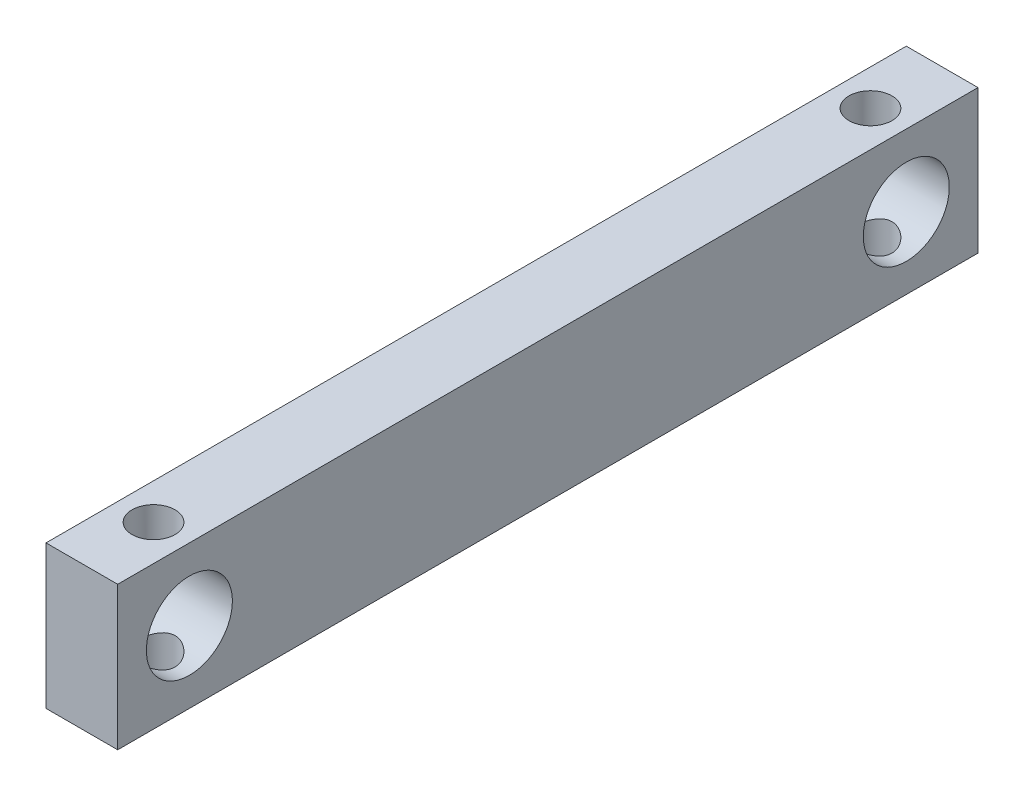
ISO-10303-21;
HEADER;
FILE_DESCRIPTION(('STEP AP214'),'2;1');
FILE_NAME('part.step','',(''),(''),'','','');
FILE_SCHEMA(('AUTOMOTIVE_DESIGN { 1 0 10303 214 1 1 1 1 }'));
ENDSEC;
DATA;
#1=APPLICATION_CONTEXT('core data for automotive mechanical design processes');
#2=APPLICATION_PROTOCOL_DEFINITION('international standard','automotive_design',2000,#1);
#3=PRODUCT_CONTEXT('',#1,'mechanical');
#4=PRODUCT('Part','Part','',(#3));
#5=PRODUCT_RELATED_PRODUCT_CATEGORY('part','',(#4));
#6=PRODUCT_DEFINITION_FORMATION('','',#4);
#7=PRODUCT_DEFINITION_CONTEXT('part definition',#1,'design');
#8=PRODUCT_DEFINITION('design','',#6,#7);
#9=PRODUCT_DEFINITION_SHAPE('','',#8);
#10=(LENGTH_UNIT() NAMED_UNIT(*) SI_UNIT(.MILLI.,.METRE.));
#11=(NAMED_UNIT(*) PLANE_ANGLE_UNIT() SI_UNIT($,.RADIAN.));
#12=(NAMED_UNIT(*) SI_UNIT($,.STERADIAN.) SOLID_ANGLE_UNIT());
#13=UNCERTAINTY_MEASURE_WITH_UNIT(LENGTH_MEASURE(1.E-05),#10,'distance_accuracy_value','');
#14=(GEOMETRIC_REPRESENTATION_CONTEXT(3) GLOBAL_UNCERTAINTY_ASSIGNED_CONTEXT((#13)) GLOBAL_UNIT_ASSIGNED_CONTEXT((#10,
#11,#12)) REPRESENTATION_CONTEXT('',''));
#15=CARTESIAN_POINT('',(0.,0.,0.));
#16=DIRECTION('',(0.,0.,1.));
#17=DIRECTION('',(1.,0.,0.));
#18=AXIS2_PLACEMENT_3D('',#15,#16,#17);
#19=CARTESIAN_POINT('',(2.5,0.,0.));
#20=DIRECTION('',(-1.,0.,0.));
#21=DIRECTION('',(0.,0.,1.));
#22=AXIS2_PLACEMENT_3D('',#19,#20,#21);
#23=PLANE('',#22);
#24=DIRECTION('',(0.,1.,0.));
#25=VECTOR('',#24,1.);
#26=CARTESIAN_POINT('',(2.5,-5.,-30.));
#27=LINE('',#26,#25);
#28=CARTESIAN_POINT('',(2.5,-5.,-30.));
#29=VERTEX_POINT('',#28);
#30=CARTESIAN_POINT('',(2.5,5.,-30.));
#31=VERTEX_POINT('',#30);
#32=EDGE_CURVE('E99',#29,#31,#27,.T.);
#33=ORIENTED_EDGE('',*,*,#32,.T.);
#34=DIRECTION('',(0.,0.,1.));
#35=VECTOR('',#34,1.);
#36=CARTESIAN_POINT('',(2.5,5.,30.));
#37=LINE('',#36,#35);
#38=CARTESIAN_POINT('',(2.5,5.,30.));
#39=VERTEX_POINT('',#38);
#40=EDGE_CURVE('E94',#31,#39,#37,.T.);
#41=ORIENTED_EDGE('',*,*,#40,.T.);
#42=DIRECTION('',(0.,-1.,0.));
#43=VECTOR('',#42,1.);
#44=CARTESIAN_POINT('',(2.5,-5.,30.));
#45=LINE('',#44,#43);
#46=CARTESIAN_POINT('',(2.5,-5.,30.));
#47=VERTEX_POINT('',#46);
#48=EDGE_CURVE('E97',#39,#47,#45,.T.);
#49=ORIENTED_EDGE('',*,*,#48,.T.);
#50=DIRECTION('',(0.,0.,-1.));
#51=VECTOR('',#50,1.);
#52=CARTESIAN_POINT('',(2.5,-5.,30.));
#53=LINE('',#52,#51);
#54=EDGE_CURVE('E64',#47,#29,#53,.T.);
#55=ORIENTED_EDGE('',*,*,#54,.T.);
#56=EDGE_LOOP('',(#33,#41,#49,#55));
#57=FACE_BOUND('',#56,.T.);
#58=CARTESIAN_POINT('',(2.5,0.,25.));
#59=DIRECTION('',(1.,0.,0.));
#60=DIRECTION('',(0.,0.,-1.));
#61=AXIS2_PLACEMENT_3D('',#58,#59,#60);
#62=CIRCLE('',#61,3.);
#63=CARTESIAN_POINT('',(2.5,0.,22.));
#64=VERTEX_POINT('',#63);
#65=EDGE_CURVE('E120',#64,#64,#62,.T.);
#66=ORIENTED_EDGE('',*,*,#65,.F.);
#67=EDGE_LOOP('',(#66));
#68=FACE_BOUND('',#67,.T.);
#69=CARTESIAN_POINT('',(2.5,0.,-25.));
#70=DIRECTION('',(1.,0.,0.));
#71=DIRECTION('',(0.,0.,1.));
#72=AXIS2_PLACEMENT_3D('',#69,#70,#71);
#73=CIRCLE('',#72,3.);
#74=CARTESIAN_POINT('',(2.5,0.,-22.));
#75=VERTEX_POINT('',#74);
#76=EDGE_CURVE('E205',#75,#75,#73,.T.);
#77=ORIENTED_EDGE('',*,*,#76,.F.);
#78=EDGE_LOOP('',(#77));
#79=FACE_BOUND('',#78,.T.);
#80=ADVANCED_FACE('F39',(#57,#68,#79),#23,.F.);
#81=CARTESIAN_POINT('',(-2.5,0.,0.));
#82=DIRECTION('',(-1.,0.,0.));
#83=DIRECTION('',(0.,0.,1.));
#84=AXIS2_PLACEMENT_3D('',#81,#82,#83);
#85=PLANE('',#84);
#86=CARTESIAN_POINT('',(-2.5,0.,25.));
#87=DIRECTION('',(1.,0.,0.));
#88=DIRECTION('',(0.,0.,-1.));
#89=AXIS2_PLACEMENT_3D('',#86,#87,#88);
#90=CIRCLE('',#89,3.);
#91=CARTESIAN_POINT('',(-2.5,0.,22.));
#92=VERTEX_POINT('',#91);
#93=EDGE_CURVE('E209',#92,#92,#90,.T.);
#94=ORIENTED_EDGE('',*,*,#93,.T.);
#95=EDGE_LOOP('',(#94));
#96=FACE_BOUND('',#95,.T.);
#97=DIRECTION('',(0.,1.,0.));
#98=VECTOR('',#97,1.);
#99=CARTESIAN_POINT('',(-2.5,-5.,-30.));
#100=LINE('',#99,#98);
#101=CARTESIAN_POINT('',(-2.5,-5.,-30.));
#102=VERTEX_POINT('',#101);
#103=CARTESIAN_POINT('',(-2.5,5.,-30.));
#104=VERTEX_POINT('',#103);
#105=EDGE_CURVE('E116',#102,#104,#100,.T.);
#106=ORIENTED_EDGE('',*,*,#105,.F.);
#107=DIRECTION('',(0.,0.,-1.));
#108=VECTOR('',#107,1.);
#109=CARTESIAN_POINT('',(-2.5,-5.,30.));
#110=LINE('',#109,#108);
#111=CARTESIAN_POINT('',(-2.5,-5.,30.));
#112=VERTEX_POINT('',#111);
#113=EDGE_CURVE('E87',#112,#102,#110,.T.);
#114=ORIENTED_EDGE('',*,*,#113,.F.);
#115=DIRECTION('',(0.,-1.,0.));
#116=VECTOR('',#115,1.);
#117=CARTESIAN_POINT('',(-2.5,-5.,30.));
#118=LINE('',#117,#116);
#119=CARTESIAN_POINT('',(-2.5,5.,30.));
#120=VERTEX_POINT('',#119);
#121=EDGE_CURVE('E81',#120,#112,#118,.T.);
#122=ORIENTED_EDGE('',*,*,#121,.F.);
#123=DIRECTION('',(0.,0.,1.));
#124=VECTOR('',#123,1.);
#125=CARTESIAN_POINT('',(-2.5,5.,30.));
#126=LINE('',#125,#124);
#127=EDGE_CURVE('E104',#104,#120,#126,.T.);
#128=ORIENTED_EDGE('',*,*,#127,.F.);
#129=EDGE_LOOP('',(#106,#114,#122,#128));
#130=FACE_BOUND('',#129,.T.);
#131=CARTESIAN_POINT('',(-2.5,0.,-25.));
#132=DIRECTION('',(1.,0.,0.));
#133=DIRECTION('',(0.,0.,1.));
#134=AXIS2_PLACEMENT_3D('',#131,#132,#133);
#135=CIRCLE('',#134,3.);
#136=CARTESIAN_POINT('',(-2.5,0.,-22.));
#137=VERTEX_POINT('',#136);
#138=EDGE_CURVE('E210',#137,#137,#135,.T.);
#139=ORIENTED_EDGE('',*,*,#138,.T.);
#140=EDGE_LOOP('',(#139));
#141=FACE_BOUND('',#140,.T.);
#142=ADVANCED_FACE('F174',(#96,#130,#141),#85,.T.);
#143=CARTESIAN_POINT('',(2.5,-5.,-30.));
#144=DIRECTION('',(0.,0.,1.));
#145=DIRECTION('',(1.,0.,0.));
#146=AXIS2_PLACEMENT_3D('',#143,#144,#145);
#147=PLANE('',#146);
#148=ORIENTED_EDGE('',*,*,#105,.T.);
#149=DIRECTION('',(-1.,0.,0.));
#150=VECTOR('',#149,1.);
#151=CARTESIAN_POINT('',(2.5,5.,-30.));
#152=LINE('',#151,#150);
#153=EDGE_CURVE('E11',#31,#104,#152,.T.);
#154=ORIENTED_EDGE('',*,*,#153,.F.);
#155=ORIENTED_EDGE('',*,*,#32,.F.);
#156=DIRECTION('',(-1.,0.,0.));
#157=VECTOR('',#156,1.);
#158=CARTESIAN_POINT('',(2.5,-5.,-30.));
#159=LINE('',#158,#157);
#160=EDGE_CURVE('E112',#29,#102,#159,.T.);
#161=ORIENTED_EDGE('',*,*,#160,.T.);
#162=EDGE_LOOP('',(#148,#154,#155,#161));
#163=FACE_BOUND('',#162,.T.);
#164=ADVANCED_FACE('F41',(#163),#147,.F.);
#165=CARTESIAN_POINT('',(2.5,5.,30.));
#166=DIRECTION('',(0.,-1.,0.));
#167=DIRECTION('',(0.,0.,-1.));
#168=AXIS2_PLACEMENT_3D('',#165,#166,#167);
#169=PLANE('',#168);
#170=CARTESIAN_POINT('',(0.,5.,-25.));
#171=DIRECTION('',(0.,1.,0.));
#172=DIRECTION('',(0.,0.,1.));
#173=AXIS2_PLACEMENT_3D('',#170,#171,#172);
#174=CIRCLE('',#173,1.5);
#175=CARTESIAN_POINT('',(0.,5.,-23.5));
#176=VERTEX_POINT('',#175);
#177=EDGE_CURVE('E191',#176,#176,#174,.T.);
#178=ORIENTED_EDGE('',*,*,#177,.F.);
#179=EDGE_LOOP('',(#178));
#180=FACE_BOUND('',#179,.T.);
#181=CARTESIAN_POINT('',(0.,5.,25.));
#182=DIRECTION('',(0.,1.,0.));
#183=DIRECTION('',(0.,0.,-1.));
#184=AXIS2_PLACEMENT_3D('',#181,#182,#183);
#185=CIRCLE('',#184,1.5);
#186=CARTESIAN_POINT('',(0.,5.,23.5));
#187=VERTEX_POINT('',#186);
#188=EDGE_CURVE('E194',#187,#187,#185,.T.);
#189=ORIENTED_EDGE('',*,*,#188,.F.);
#190=EDGE_LOOP('',(#189));
#191=FACE_BOUND('',#190,.T.);
#192=ORIENTED_EDGE('',*,*,#127,.T.);
#193=DIRECTION('',(-1.,0.,0.));
#194=VECTOR('',#193,1.);
#195=CARTESIAN_POINT('',(2.5,5.,30.));
#196=LINE('',#195,#194);
#197=EDGE_CURVE('E55',#39,#120,#196,.T.);
#198=ORIENTED_EDGE('',*,*,#197,.F.);
#199=ORIENTED_EDGE('',*,*,#40,.F.);
#200=ORIENTED_EDGE('',*,*,#153,.T.);
#201=EDGE_LOOP('',(#192,#198,#199,#200));
#202=FACE_BOUND('',#201,.T.);
#203=ADVANCED_FACE('F103',(#180,#191,#202),#169,.F.);
#204=CARTESIAN_POINT('',(2.5,-5.,30.));
#205=DIRECTION('',(0.,0.,-1.));
#206=DIRECTION('',(0.,1.,0.));
#207=AXIS2_PLACEMENT_3D('',#204,#205,#206);
#208=PLANE('',#207);
#209=ORIENTED_EDGE('',*,*,#121,.T.);
#210=DIRECTION('',(-1.,0.,0.));
#211=VECTOR('',#210,1.);
#212=CARTESIAN_POINT('',(2.5,-5.,30.));
#213=LINE('',#212,#211);
#214=EDGE_CURVE('E106',#47,#112,#213,.T.);
#215=ORIENTED_EDGE('',*,*,#214,.F.);
#216=ORIENTED_EDGE('',*,*,#48,.F.);
#217=ORIENTED_EDGE('',*,*,#197,.T.);
#218=EDGE_LOOP('',(#209,#215,#216,#217));
#219=FACE_BOUND('',#218,.T.);
#220=ADVANCED_FACE('F108',(#219),#208,.F.);
#221=CARTESIAN_POINT('',(2.5,-5.,30.));
#222=DIRECTION('',(0.,1.,0.));
#223=DIRECTION('',(0.,0.,1.));
#224=AXIS2_PLACEMENT_3D('',#221,#222,#223);
#225=PLANE('',#224);
#226=CARTESIAN_POINT('',(0.,-5.,-25.));
#227=DIRECTION('',(0.,1.,0.));
#228=DIRECTION('',(0.,0.,1.));
#229=AXIS2_PLACEMENT_3D('',#226,#227,#228);
#230=CIRCLE('',#229,1.5);
#231=CARTESIAN_POINT('',(0.,-5.,-23.5));
#232=VERTEX_POINT('',#231);
#233=EDGE_CURVE('E141',#232,#232,#230,.T.);
#234=ORIENTED_EDGE('',*,*,#233,.T.);
#235=EDGE_LOOP('',(#234));
#236=FACE_BOUND('',#235,.T.);
#237=CARTESIAN_POINT('',(0.,-5.,25.));
#238=DIRECTION('',(0.,1.,0.));
#239=DIRECTION('',(0.,0.,-1.));
#240=AXIS2_PLACEMENT_3D('',#237,#238,#239);
#241=CIRCLE('',#240,1.5);
#242=CARTESIAN_POINT('',(0.,-5.,23.5));
#243=VERTEX_POINT('',#242);
#244=EDGE_CURVE('E197',#243,#243,#241,.T.);
#245=ORIENTED_EDGE('',*,*,#244,.T.);
#246=EDGE_LOOP('',(#245));
#247=FACE_BOUND('',#246,.T.);
#248=ORIENTED_EDGE('',*,*,#113,.T.);
#249=ORIENTED_EDGE('',*,*,#160,.F.);
#250=ORIENTED_EDGE('',*,*,#54,.F.);
#251=ORIENTED_EDGE('',*,*,#214,.T.);
#252=EDGE_LOOP('',(#248,#249,#250,#251));
#253=FACE_BOUND('',#252,.T.);
#254=ADVANCED_FACE('F169',(#236,#247,#253),#225,.F.);
#255=CARTESIAN_POINT('',(2.5,0.,25.));
#256=DIRECTION('',(-1.,0.,0.));
#257=DIRECTION('',(0.,0.,1.));
#258=AXIS2_PLACEMENT_3D('',#255,#256,#257);
#259=CYLINDRICAL_SURFACE('',#258,3.);
#260=CARTESIAN_POINT('',(0.,-2.59807621135332,26.5));
#261=CARTESIAN_POINT('',(0.0781617122928752,-2.59808302092689,26.4999945446118));
#262=CARTESIAN_POINT('',(0.156422117287568,-2.60165701781635,26.4938499560998));
#263=CARTESIAN_POINT('',(0.310540897015729,-2.61543549678079,26.4695848148471));
#264=CARTESIAN_POINT('',(0.386393872565112,-2.62565391083339,26.4514390968313));
#265=CARTESIAN_POINT('',(0.533177496515911,-2.65124019908098,26.4041499230497));
#266=CARTESIAN_POINT('',(0.60413197871038,-2.66658065209878,26.3750649287406));
#267=CARTESIAN_POINT('',(0.74013630299508,-2.70063997225287,26.3069012880646));
#268=CARTESIAN_POINT('',(0.805185825393687,-2.71935902214097,26.2678221010537));
#269=CARTESIAN_POINT('',(0.93345859283626,-2.75995303586162,26.1769998107963));
#270=CARTESIAN_POINT('',(0.996088703510316,-2.7819609545693,26.1244780542157));
#271=CARTESIAN_POINT('',(1.11211258261007,-2.82557974178559,26.0098807114217));
#272=CARTESIAN_POINT('',(1.16550174387528,-2.84719040746875,25.9478003886734));
#273=CARTESIAN_POINT('',(1.2650507267215,-2.88932215429424,25.8107343451218));
#274=CARTESIAN_POINT('',(1.3104806517893,-2.90967159627259,25.7351607835189));
#275=CARTESIAN_POINT('',(1.38771127986864,-2.94526134149294,25.5762355398993));
#276=CARTESIAN_POINT('',(1.41952058420576,-2.96050486775612,25.4928888072072));
#277=CARTESIAN_POINT('',(1.46625699195165,-2.98320691866356,25.327067415889));
#278=CARTESIAN_POINT('',(1.4822242895333,-2.99114220331338,25.2449526857332));
#279=CARTESIAN_POINT('',(1.50024917801256,-3.00011375769101,25.0788559430468));
#280=CARTESIAN_POINT('',(1.50231518519357,-3.00115420176885,24.9948750912344));
#281=CARTESIAN_POINT('',(1.49287998904448,-2.99644472874675,24.8352512133644));
#282=CARTESIAN_POINT('',(1.48254297671817,-2.99127743838241,24.7595182012348));
#283=CARTESIAN_POINT('',(1.45067873414301,-2.97561367889621,24.6110293421225));
#284=CARTESIAN_POINT('',(1.42915066653567,-2.96511681099591,24.5382737183591));
#285=CARTESIAN_POINT('',(1.37537615086528,-2.93957374931482,24.3965359126457));
#286=CARTESIAN_POINT('',(1.3429855302419,-2.92446662293799,24.3276198647272));
#287=CARTESIAN_POINT('',(1.26860487569776,-2.89106468980031,24.19603479773));
#288=CARTESIAN_POINT('',(1.22661140504648,-2.87276874236226,24.133368026742));
#289=CARTESIAN_POINT('',(1.12965697270048,-2.83266591598844,24.0097395086527));
#290=CARTESIAN_POINT('',(1.07384545751099,-2.81069063997263,23.949498887456));
#291=CARTESIAN_POINT('',(0.953115412604736,-2.76681510880218,23.8388434445533));
#292=CARTESIAN_POINT('',(0.888189941588908,-2.74491492398443,23.7884361826387));
#293=CARTESIAN_POINT('',(0.746027711363871,-2.70216234138727,23.6957419980367));
#294=CARTESIAN_POINT('',(0.668270965418685,-2.68146479986061,23.6541740275329));
#295=CARTESIAN_POINT('',(0.505593492961504,-2.64563175417864,23.5850213304982));
#296=CARTESIAN_POINT('',(0.420680350473658,-2.63049045069101,23.5574220126837));
#297=CARTESIAN_POINT('',(0.253178233075813,-2.60916953725552,23.5192296834624));
#298=CARTESIAN_POINT('',(0.170938321434672,-2.60237483772745,23.50746231682));
#299=CARTESIAN_POINT('',(0.00539798772518675,-2.59676879042414,23.4977245800829));
#300=CARTESIAN_POINT('',(-0.077901643679681,-2.59795180333967,23.4997444640275));
#301=CARTESIAN_POINT('',(-0.233480877868093,-2.60751504810877,23.5164459349841));
#302=CARTESIAN_POINT('',(-0.305969176661892,-2.61509381259981,23.5297182749313));
#303=CARTESIAN_POINT('',(-0.447551679406438,-2.63541032327012,23.5664555730513));
#304=CARTESIAN_POINT('',(-0.516644776119913,-2.64814974007551,23.5899238320646));
#305=CARTESIAN_POINT('',(-0.653116996354043,-2.67804333119485,23.6475286170927));
#306=CARTESIAN_POINT('',(-0.720268525280327,-2.69537464864595,23.6821089044609));
#307=CARTESIAN_POINT('',(-0.848203907308489,-2.73234179245875,23.7605694039763));
#308=CARTESIAN_POINT('',(-0.908984465269924,-2.75197880032721,23.8044543935017));
#309=CARTESIAN_POINT('',(-1.03046815128532,-2.79431997684504,23.9067442492017));
#310=CARTESIAN_POINT('',(-1.09019572607649,-2.81709874731434,23.9662820915275));
#311=CARTESIAN_POINT('',(-1.19911835699039,-2.86101352466839,24.0948932569026));
#312=CARTESIAN_POINT('',(-1.24830985534581,-2.88214897511564,24.163969788017));
#313=CARTESIAN_POINT('',(-1.33586058892515,-2.92112042536435,24.3121969561619));
#314=CARTESIAN_POINT('',(-1.37389967731637,-2.93885462508044,24.3915653536388));
#315=CARTESIAN_POINT('',(-1.43570685578609,-2.96825032438952,24.5567164530384));
#316=CARTESIAN_POINT('',(-1.45948747704946,-2.9799171551456,24.6424934479117));
#317=CARTESIAN_POINT('',(-1.49005284626199,-2.99501262272824,24.8095304765044));
#318=CARTESIAN_POINT('',(-1.49819681381417,-2.99909891862287,24.8904828342243));
#319=CARTESIAN_POINT('',(-1.5012648981816,-3.00063195562697,25.0526889789268));
#320=CARTESIAN_POINT('',(-1.49619364278535,-2.99808102100335,25.1339426504426));
#321=CARTESIAN_POINT('',(-1.47387538980656,-2.98700953256884,25.2888069884757));
#322=CARTESIAN_POINT('',(-1.45745272611349,-2.97889342001985,25.3625684767169));
#323=CARTESIAN_POINT('',(-1.41400950104554,-2.95788140495135,25.5061689282754));
#324=CARTESIAN_POINT('',(-1.38698741985982,-2.94498481699194,25.5760073274333));
#325=CARTESIAN_POINT('',(-1.32190942175104,-2.9148889612218,25.7131351093673));
#326=CARTESIAN_POINT('',(-1.28343101518824,-2.89752925798199,25.7801877140501));
#327=CARTESIAN_POINT('',(-1.19706310371143,-2.86032199712739,25.907161962721));
#328=CARTESIAN_POINT('',(-1.14916927632649,-2.84047329837541,25.9670803111224));
#329=CARTESIAN_POINT('',(-1.03980429146595,-2.79792915339942,26.0843710062353));
#330=CARTESIAN_POINT('',(-0.977456268784212,-2.77514698517547,26.1408965268089));
#331=CARTESIAN_POINT('',(-0.843823918305344,-2.73094614244278,26.242994931092));
#332=CARTESIAN_POINT('',(-0.772531768698474,-2.70952868642798,26.2885581250151));
#333=CARTESIAN_POINT('',(-0.620045030128567,-2.66999407957374,26.3686466196785));
#334=CARTESIAN_POINT('',(-0.538608703306896,-2.65200261384405,26.4027775989414));
#335=CARTESIAN_POINT('',(-0.370001393490333,-2.62299234492527,26.4563180642596));
#336=CARTESIAN_POINT('',(-0.28285066663097,-2.61195024221553,26.475776786763));
#337=CARTESIAN_POINT('',(-0.162291966522004,-2.60293908902686,26.4915505117966));
#338=CARTESIAN_POINT('',(-0.129948158403173,-2.60112193507728,26.4947141574458));
#339=CARTESIAN_POINT('',(-0.0650752789766339,-2.59868903831625,26.4989401076349));
#340=CARTESIAN_POINT('',(-0.0325461954211881,-2.59807337587664,26.5000022715998));
#341=CARTESIAN_POINT('',(0.,-2.59807621135332,26.5));
#342=B_SPLINE_CURVE_WITH_KNOTS('',3,(#260,#261,#262,#263,#264,#265,#266,#267,#268,#269,#270,
#271,#272,#273,#274,#275,#276,#277,#278,#279,#280,#281,#282,#283,#284,#285,#286,#287,#288,#289,
#290,#291,#292,#293,#294,#295,#296,#297,#298,#299,#300,#301,#302,#303,#304,#305,#306,#307,#308,
#309,#310,#311,#312,#313,#314,#315,#316,#317,#318,#319,#320,#321,#322,#323,#324,#325,#326,#327,
#328,#329,#330,#331,#332,#333,#334,#335,#336,#337,#338,#339,#340,#341),.UNSPECIFIED.,.T.,.F.,(4,
2,2,2,2,2,2,2,2,2,2,2,2,2,2,2,2,2,2,2,2,2,2,2,2,2,2,2,2,2,2,2,2,2,2,2,2,2,2,2,4),(0.,
0.234348183892074,0.469189339237207,0.702792893878329,0.936409088167724,1.18929346874735,
1.44230356626556,1.71236838358146,1.98226240445837,2.23295227451903,2.4834903552906,
2.71224146226808,2.94100968776183,3.1729430209672,3.40495949025408,3.65890787185336,
3.91305072368878,4.18333262594173,4.45333161317558,4.70193436281318,4.9503613978256,
5.17161275136039,5.39293578654095,5.62450944609131,5.85620229330071,6.1171011537092,
6.37808797467304,6.64596272119449,6.91360169713158,7.15668405584231,7.39968130190958,
7.62666637307239,7.8536840026802,8.09041126079208,8.32724745151079,8.58765362775101,
8.84828914267732,9.11716123557908,9.38512699504141,9.48270202777964,9.58028358741811),.UNSPECIFIED.);
#343=CARTESIAN_POINT('',(0.,-2.59807621135332,26.5));
#344=VERTEX_POINT('',#343);
#345=EDGE_CURVE('E43',#344,#344,#342,.T.);
#346=ORIENTED_EDGE('',*,*,#345,.F.);
#347=EDGE_LOOP('',(#346));
#348=FACE_BOUND('',#347,.T.);
#349=CARTESIAN_POINT('',(0.,2.59807621135332,26.5));
#350=CARTESIAN_POINT('',(-0.0781617122928752,2.59808302092689,26.4999945446118));
#351=CARTESIAN_POINT('',(-0.156422117287568,2.60165701781635,26.4938499560998));
#352=CARTESIAN_POINT('',(-0.310540897015729,2.61543549678079,26.4695848148471));
#353=CARTESIAN_POINT('',(-0.386393872565112,2.62565391083339,26.4514390968313));
#354=CARTESIAN_POINT('',(-0.533177496515911,2.65124019908098,26.4041499230497));
#355=CARTESIAN_POINT('',(-0.60413197871038,2.66658065209878,26.3750649287406));
#356=CARTESIAN_POINT('',(-0.74013630299508,2.70063997225287,26.3069012880646));
#357=CARTESIAN_POINT('',(-0.805185825393687,2.71935902214097,26.2678221010537));
#358=CARTESIAN_POINT('',(-0.93345859283626,2.75995303586162,26.1769998107963));
#359=CARTESIAN_POINT('',(-0.996088703510316,2.7819609545693,26.1244780542157));
#360=CARTESIAN_POINT('',(-1.11211258261007,2.82557974178559,26.0098807114217));
#361=CARTESIAN_POINT('',(-1.16550174387528,2.84719040746875,25.9478003886734));
#362=CARTESIAN_POINT('',(-1.2650507267215,2.88932215429424,25.8107343451218));
#363=CARTESIAN_POINT('',(-1.3104806517893,2.90967159627259,25.7351607835189));
#364=CARTESIAN_POINT('',(-1.38771127986864,2.94526134149294,25.5762355398993));
#365=CARTESIAN_POINT('',(-1.41952058420576,2.96050486775612,25.4928888072072));
#366=CARTESIAN_POINT('',(-1.46625699195165,2.98320691866356,25.327067415889));
#367=CARTESIAN_POINT('',(-1.4822242895333,2.99114220331338,25.2449526857332));
#368=CARTESIAN_POINT('',(-1.50024917801256,3.00011375769101,25.0788559430468));
#369=CARTESIAN_POINT('',(-1.50231518519357,3.00115420176885,24.9948750912344));
#370=CARTESIAN_POINT('',(-1.49287998904448,2.99644472874675,24.8352512133644));
#371=CARTESIAN_POINT('',(-1.48254297671817,2.99127743838241,24.7595182012348));
#372=CARTESIAN_POINT('',(-1.45067873414301,2.97561367889621,24.6110293421225));
#373=CARTESIAN_POINT('',(-1.42915066653567,2.96511681099591,24.5382737183591));
#374=CARTESIAN_POINT('',(-1.37537615086528,2.93957374931482,24.3965359126457));
#375=CARTESIAN_POINT('',(-1.3429855302419,2.92446662293799,24.3276198647272));
#376=CARTESIAN_POINT('',(-1.26860487569776,2.89106468980031,24.19603479773));
#377=CARTESIAN_POINT('',(-1.22661140504648,2.87276874236226,24.133368026742));
#378=CARTESIAN_POINT('',(-1.12965697270048,2.83266591598844,24.0097395086527));
#379=CARTESIAN_POINT('',(-1.07384545751099,2.81069063997263,23.949498887456));
#380=CARTESIAN_POINT('',(-0.953115412604736,2.76681510880218,23.8388434445533));
#381=CARTESIAN_POINT('',(-0.888189941588908,2.74491492398443,23.7884361826387));
#382=CARTESIAN_POINT('',(-0.746027711363871,2.70216234138727,23.6957419980367));
#383=CARTESIAN_POINT('',(-0.668270965418685,2.68146479986061,23.6541740275329));
#384=CARTESIAN_POINT('',(-0.505593492961504,2.64563175417864,23.5850213304982));
#385=CARTESIAN_POINT('',(-0.420680350473658,2.63049045069101,23.5574220126837));
#386=CARTESIAN_POINT('',(-0.253178233075813,2.60916953725552,23.5192296834624));
#387=CARTESIAN_POINT('',(-0.170938321434672,2.60237483772745,23.50746231682));
#388=CARTESIAN_POINT('',(-0.00539798772518675,2.59676879042414,23.4977245800829));
#389=CARTESIAN_POINT('',(0.077901643679681,2.59795180333967,23.4997444640275));
#390=CARTESIAN_POINT('',(0.233480877868093,2.60751504810877,23.5164459349841));
#391=CARTESIAN_POINT('',(0.305969176661892,2.61509381259981,23.5297182749313));
#392=CARTESIAN_POINT('',(0.447551679406438,2.63541032327012,23.5664555730513));
#393=CARTESIAN_POINT('',(0.516644776119913,2.64814974007551,23.5899238320646));
#394=CARTESIAN_POINT('',(0.653116996354043,2.67804333119485,23.6475286170927));
#395=CARTESIAN_POINT('',(0.720268525280327,2.69537464864595,23.6821089044609));
#396=CARTESIAN_POINT('',(0.848203907308489,2.73234179245875,23.7605694039763));
#397=CARTESIAN_POINT('',(0.908984465269924,2.75197880032721,23.8044543935017));
#398=CARTESIAN_POINT('',(1.03046815128532,2.79431997684504,23.9067442492017));
#399=CARTESIAN_POINT('',(1.09019572607649,2.81709874731434,23.9662820915275));
#400=CARTESIAN_POINT('',(1.19911835699039,2.86101352466839,24.0948932569026));
#401=CARTESIAN_POINT('',(1.24830985534581,2.88214897511564,24.163969788017));
#402=CARTESIAN_POINT('',(1.33586058892515,2.92112042536435,24.3121969561619));
#403=CARTESIAN_POINT('',(1.37389967731637,2.93885462508044,24.3915653536388));
#404=CARTESIAN_POINT('',(1.43570685578609,2.96825032438952,24.5567164530384));
#405=CARTESIAN_POINT('',(1.45948747704946,2.9799171551456,24.6424934479117));
#406=CARTESIAN_POINT('',(1.49005284626199,2.99501262272824,24.8095304765044));
#407=CARTESIAN_POINT('',(1.49819681381417,2.99909891862287,24.8904828342243));
#408=CARTESIAN_POINT('',(1.5012648981816,3.00063195562697,25.0526889789268));
#409=CARTESIAN_POINT('',(1.49619364278535,2.99808102100335,25.1339426504426));
#410=CARTESIAN_POINT('',(1.47387538980656,2.98700953256884,25.2888069884757));
#411=CARTESIAN_POINT('',(1.45745272611349,2.97889342001985,25.3625684767169));
#412=CARTESIAN_POINT('',(1.41400950104554,2.95788140495135,25.5061689282754));
#413=CARTESIAN_POINT('',(1.38698741985982,2.94498481699194,25.5760073274333));
#414=CARTESIAN_POINT('',(1.32190942175104,2.9148889612218,25.7131351093673));
#415=CARTESIAN_POINT('',(1.28343101518824,2.89752925798199,25.7801877140501));
#416=CARTESIAN_POINT('',(1.19706310371143,2.86032199712739,25.907161962721));
#417=CARTESIAN_POINT('',(1.14916927632649,2.84047329837541,25.9670803111224));
#418=CARTESIAN_POINT('',(1.03980429146595,2.79792915339942,26.0843710062353));
#419=CARTESIAN_POINT('',(0.977456268784212,2.77514698517547,26.1408965268089));
#420=CARTESIAN_POINT('',(0.843823918305344,2.73094614244278,26.242994931092));
#421=CARTESIAN_POINT('',(0.772531768698474,2.70952868642798,26.2885581250151));
#422=CARTESIAN_POINT('',(0.620045030128567,2.66999407957374,26.3686466196785));
#423=CARTESIAN_POINT('',(0.538608703306896,2.65200261384405,26.4027775989414));
#424=CARTESIAN_POINT('',(0.370001393490333,2.62299234492527,26.4563180642596));
#425=CARTESIAN_POINT('',(0.28285066663097,2.61195024221553,26.475776786763));
#426=CARTESIAN_POINT('',(0.162291966522004,2.60293908902686,26.4915505117966));
#427=CARTESIAN_POINT('',(0.129948158403173,2.60112193507728,26.4947141574458));
#428=CARTESIAN_POINT('',(0.0650752789766339,2.59868903831625,26.4989401076349));
#429=CARTESIAN_POINT('',(0.0325461954211881,2.59807337587664,26.5000022715998));
#430=CARTESIAN_POINT('',(0.,2.59807621135332,26.5));
#431=B_SPLINE_CURVE_WITH_KNOTS('',3,(#349,#350,#351,#352,#353,#354,#355,#356,#357,#358,#359,
#360,#361,#362,#363,#364,#365,#366,#367,#368,#369,#370,#371,#372,#373,#374,#375,#376,#377,#378,
#379,#380,#381,#382,#383,#384,#385,#386,#387,#388,#389,#390,#391,#392,#393,#394,#395,#396,#397,
#398,#399,#400,#401,#402,#403,#404,#405,#406,#407,#408,#409,#410,#411,#412,#413,#414,#415,#416,
#417,#418,#419,#420,#421,#422,#423,#424,#425,#426,#427,#428,#429,#430),.UNSPECIFIED.,.T.,.F.,(4,
2,2,2,2,2,2,2,2,2,2,2,2,2,2,2,2,2,2,2,2,2,2,2,2,2,2,2,2,2,2,2,2,2,2,2,2,2,2,2,4),(0.,
0.234348183892074,0.469189339237207,0.702792893878329,0.936409088167724,1.18929346874735,
1.44230356626556,1.71236838358146,1.98226240445837,2.23295227451903,2.4834903552906,
2.71224146226808,2.94100968776183,3.1729430209672,3.40495949025408,3.65890787185336,
3.91305072368878,4.18333262594173,4.45333161317558,4.70193436281318,4.9503613978256,
5.17161275136039,5.39293578654095,5.62450944609131,5.85620229330071,6.1171011537092,
6.37808797467304,6.64596272119449,6.91360169713158,7.15668405584231,7.39968130190958,
7.62666637307239,7.8536840026802,8.09041126079208,8.32724745151079,8.58765362775101,
8.84828914267732,9.11716123557908,9.38512699504141,9.48270202777964,9.58028358741811),.UNSPECIFIED.);
#432=CARTESIAN_POINT('',(0.,2.59807621135332,26.5));
#433=VERTEX_POINT('',#432);
#434=EDGE_CURVE('E159',#433,#433,#431,.T.);
#435=ORIENTED_EDGE('',*,*,#434,.F.);
#436=EDGE_LOOP('',(#435));
#437=FACE_BOUND('',#436,.T.);
#438=ORIENTED_EDGE('',*,*,#65,.T.);
#439=EDGE_LOOP('',(#438));
#440=FACE_BOUND('',#439,.T.);
#441=ORIENTED_EDGE('',*,*,#93,.F.);
#442=EDGE_LOOP('',(#441));
#443=FACE_BOUND('',#442,.T.);
#444=ADVANCED_FACE('F165',(#348,#437,#440,#443),#259,.F.);
#445=CARTESIAN_POINT('',(2.5,0.,-25.));
#446=DIRECTION('',(-1.,0.,0.));
#447=DIRECTION('',(0.,0.,1.));
#448=AXIS2_PLACEMENT_3D('',#445,#446,#447);
#449=CYLINDRICAL_SURFACE('',#448,3.);
#450=CARTESIAN_POINT('',(0.,-2.59807621135332,-23.5));
#451=CARTESIAN_POINT('',(0.0781617122928752,-2.59808302092689,-23.5000054553882));
#452=CARTESIAN_POINT('',(0.156422117287569,-2.60165701781635,-23.5061500439002));
#453=CARTESIAN_POINT('',(0.31054089701573,-2.61543549678079,-23.5304151851529));
#454=CARTESIAN_POINT('',(0.386393872565112,-2.62565391083339,-23.5485609031687));
#455=CARTESIAN_POINT('',(0.53317749651591,-2.65124019908098,-23.5958500769503));
#456=CARTESIAN_POINT('',(0.604131978710378,-2.66658065209878,-23.6249350712594));
#457=CARTESIAN_POINT('',(0.740136302995078,-2.70063997225287,-23.6930987119354));
#458=CARTESIAN_POINT('',(0.805185825393685,-2.71935902214097,-23.7321778989463));
#459=CARTESIAN_POINT('',(0.933458592836258,-2.75995303586162,-23.8230001892037));
#460=CARTESIAN_POINT('',(0.996088703510315,-2.7819609545693,-23.8755219457843));
#461=CARTESIAN_POINT('',(1.11211258261006,-2.82557974178559,-23.9901192885783));
#462=CARTESIAN_POINT('',(1.16550174387528,-2.84719040746875,-24.0521996113266));
#463=CARTESIAN_POINT('',(1.26505072672149,-2.88932215429424,-24.1892656548782));
#464=CARTESIAN_POINT('',(1.3104806517893,-2.90967159627259,-24.2648392164811));
#465=CARTESIAN_POINT('',(1.38771127986864,-2.94526134149294,-24.4237644601007));
#466=CARTESIAN_POINT('',(1.41952058420576,-2.96050486775613,-24.5071111927928));
#467=CARTESIAN_POINT('',(1.46625699195165,-2.98320691866356,-24.672932584111));
#468=CARTESIAN_POINT('',(1.4822242895333,-2.99114220331338,-24.7550473142668));
#469=CARTESIAN_POINT('',(1.50024917801256,-3.00011375769101,-24.9211440569532));
#470=CARTESIAN_POINT('',(1.50231518519357,-3.00115420176885,-25.0051249087656));
#471=CARTESIAN_POINT('',(1.49287998904448,-2.99644472874675,-25.1647487866356));
#472=CARTESIAN_POINT('',(1.48254297671817,-2.99127743838241,-25.2404817987652));
#473=CARTESIAN_POINT('',(1.45067873414301,-2.97561367889621,-25.3889706578775));
#474=CARTESIAN_POINT('',(1.42915066653567,-2.96511681099591,-25.4617262816409));
#475=CARTESIAN_POINT('',(1.37537615086528,-2.93957374931482,-25.6034640873543));
#476=CARTESIAN_POINT('',(1.3429855302419,-2.92446662293799,-25.6723801352728));
#477=CARTESIAN_POINT('',(1.26860487569776,-2.89106468980031,-25.80396520227));
#478=CARTESIAN_POINT('',(1.22661140504648,-2.87276874236226,-25.866631973258));
#479=CARTESIAN_POINT('',(1.12965697270048,-2.83266591598844,-25.9902604913473));
#480=CARTESIAN_POINT('',(1.07384545751099,-2.81069063997263,-26.050501112544));
#481=CARTESIAN_POINT('',(0.953115412604736,-2.76681510880218,-26.1611565554467));
#482=CARTESIAN_POINT('',(0.888189941588908,-2.74491492398443,-26.2115638173613));
#483=CARTESIAN_POINT('',(0.74602771136387,-2.70216234138727,-26.3042580019633));
#484=CARTESIAN_POINT('',(0.668270965418684,-2.68146479986062,-26.3458259724671));
#485=CARTESIAN_POINT('',(0.505593492961503,-2.64563175417864,-26.4149786695018));
#486=CARTESIAN_POINT('',(0.420680350473657,-2.63049045069101,-26.4425779873163));
#487=CARTESIAN_POINT('',(0.253178233075814,-2.60916953725552,-26.4807703165376));
#488=CARTESIAN_POINT('',(0.170938321434672,-2.60237483772745,-26.49253768318));
#489=CARTESIAN_POINT('',(0.00539798772518676,-2.59676879042414,-26.5022754199171));
#490=CARTESIAN_POINT('',(-0.0779016436796806,-2.59795180333968,-26.5002555359725));
#491=CARTESIAN_POINT('',(-0.233480877868092,-2.60751504810877,-26.483554065016));
#492=CARTESIAN_POINT('',(-0.305969176661891,-2.61509381259981,-26.4702817250687));
#493=CARTESIAN_POINT('',(-0.447551679406438,-2.63541032327012,-26.4335444269487));
#494=CARTESIAN_POINT('',(-0.516644776119913,-2.64814974007551,-26.4100761679354));
#495=CARTESIAN_POINT('',(-0.653116996354043,-2.67804333119485,-26.3524713829073));
#496=CARTESIAN_POINT('',(-0.720268525280327,-2.69537464864595,-26.3178910955391));
#497=CARTESIAN_POINT('',(-0.848203907308489,-2.73234179245875,-26.2394305960237));
#498=CARTESIAN_POINT('',(-0.908984465269924,-2.75197880032722,-26.1955456064983));
#499=CARTESIAN_POINT('',(-1.03046815128532,-2.79431997684504,-26.0932557507983));
#500=CARTESIAN_POINT('',(-1.09019572607649,-2.81709874731434,-26.0337179084725));
#501=CARTESIAN_POINT('',(-1.19911835699038,-2.86101352466839,-25.9051067430974));
#502=CARTESIAN_POINT('',(-1.24830985534581,-2.88214897511564,-25.836030211983));
#503=CARTESIAN_POINT('',(-1.33586058892515,-2.92112042536435,-25.6878030438381));
#504=CARTESIAN_POINT('',(-1.37389967731636,-2.93885462508044,-25.6084346463612));
#505=CARTESIAN_POINT('',(-1.43570685578609,-2.96825032438952,-25.4432835469616));
#506=CARTESIAN_POINT('',(-1.45948747704946,-2.9799171551456,-25.3575065520883));
#507=CARTESIAN_POINT('',(-1.49005284626199,-2.99501262272824,-25.1904695234956));
#508=CARTESIAN_POINT('',(-1.49819681381417,-2.99909891862287,-25.1095171657757));
#509=CARTESIAN_POINT('',(-1.5012648981816,-3.00063195562697,-24.9473110210732));
#510=CARTESIAN_POINT('',(-1.49619364278535,-2.99808102100335,-24.8660573495574));
#511=CARTESIAN_POINT('',(-1.47387538980656,-2.98700953256884,-24.7111930115243));
#512=CARTESIAN_POINT('',(-1.45745272611349,-2.97889342001985,-24.6374315232831));
#513=CARTESIAN_POINT('',(-1.41400950104554,-2.95788140495135,-24.4938310717246));
#514=CARTESIAN_POINT('',(-1.38698741985982,-2.94498481699194,-24.4239926725667));
#515=CARTESIAN_POINT('',(-1.32190942175104,-2.9148889612218,-24.2868648906327));
#516=CARTESIAN_POINT('',(-1.28343101518824,-2.89752925798199,-24.2198122859499));
#517=CARTESIAN_POINT('',(-1.19706310371142,-2.86032199712739,-24.092838037279));
#518=CARTESIAN_POINT('',(-1.14916927632649,-2.84047329837541,-24.0329196888776));
#519=CARTESIAN_POINT('',(-1.03980429146595,-2.79792915339942,-23.9156289937647));
#520=CARTESIAN_POINT('',(-0.977456268784212,-2.77514698517547,-23.8591034731911));
#521=CARTESIAN_POINT('',(-0.843823918305345,-2.73094614244279,-23.757005068908));
#522=CARTESIAN_POINT('',(-0.772531768698474,-2.70952868642798,-23.7114418749849));
#523=CARTESIAN_POINT('',(-0.620045030128567,-2.66999407957374,-23.6313533803215));
#524=CARTESIAN_POINT('',(-0.538608703306895,-2.65200261384405,-23.5972224010586));
#525=CARTESIAN_POINT('',(-0.370001393490332,-2.62299234492527,-23.5436819357404));
#526=CARTESIAN_POINT('',(-0.28285066663097,-2.61195024221553,-23.524223213237));
#527=CARTESIAN_POINT('',(-0.162291966522005,-2.60293908902686,-23.5084494882034));
#528=CARTESIAN_POINT('',(-0.129948158403174,-2.60112193507728,-23.5052858425542));
#529=CARTESIAN_POINT('',(-0.0650752789766341,-2.59868903831625,-23.5010598923651));
#530=CARTESIAN_POINT('',(-0.0325461954211882,-2.59807337587664,-23.4999977284002));
#531=CARTESIAN_POINT('',(0.,-2.59807621135332,-23.5));
#532=B_SPLINE_CURVE_WITH_KNOTS('',3,(#450,#451,#452,#453,#454,#455,#456,#457,#458,#459,#460,
#461,#462,#463,#464,#465,#466,#467,#468,#469,#470,#471,#472,#473,#474,#475,#476,#477,#478,#479,
#480,#481,#482,#483,#484,#485,#486,#487,#488,#489,#490,#491,#492,#493,#494,#495,#496,#497,#498,
#499,#500,#501,#502,#503,#504,#505,#506,#507,#508,#509,#510,#511,#512,#513,#514,#515,#516,#517,
#518,#519,#520,#521,#522,#523,#524,#525,#526,#527,#528,#529,#530,#531),.UNSPECIFIED.,.T.,.F.,(4,
2,2,2,2,2,2,2,2,2,2,2,2,2,2,2,2,2,2,2,2,2,2,2,2,2,2,2,2,2,2,2,2,2,2,2,2,2,2,2,4),(0.,
0.234348183892074,0.469189339237207,0.702792893878325,0.936409088167724,1.18929346874735,
1.44230356626556,1.71236838358146,1.98226240445837,2.23295227451903,2.4834903552906,
2.71224146226808,2.94100968776183,3.1729430209672,3.40495949025408,3.65890787185336,
3.91305072368878,4.18333262594173,4.45333161317558,4.70193436281318,4.9503613978256,
5.17161275136038,5.39293578654095,5.62450944609132,5.85620229330071,6.11710115370919,
6.37808797467303,6.64596272119449,6.91360169713158,7.15668405584231,7.39968130190958,
7.62666637307239,7.8536840026802,8.09041126079208,8.32724745151079,8.58765362775102,
8.84828914267732,9.11716123557908,9.38512699504141,9.48270202777964,9.58028358741811),.UNSPECIFIED.);
#533=CARTESIAN_POINT('',(0.,-2.59807621135332,-23.5));
#534=VERTEX_POINT('',#533);
#535=EDGE_CURVE('E140',#534,#534,#532,.T.);
#536=ORIENTED_EDGE('',*,*,#535,.F.);
#537=EDGE_LOOP('',(#536));
#538=FACE_BOUND('',#537,.T.);
#539=CARTESIAN_POINT('',(0.,2.59807621135332,-23.5));
#540=CARTESIAN_POINT('',(-0.0781617122928753,2.59808302092689,-23.5000054553882));
#541=CARTESIAN_POINT('',(-0.156422117287569,2.60165701781635,-23.5061500439002));
#542=CARTESIAN_POINT('',(-0.31054089701573,2.61543549678079,-23.5304151851529));
#543=CARTESIAN_POINT('',(-0.386393872565112,2.62565391083339,-23.5485609031687));
#544=CARTESIAN_POINT('',(-0.533177496515911,2.65124019908098,-23.5958500769503));
#545=CARTESIAN_POINT('',(-0.60413197871038,2.66658065209878,-23.6249350712594));
#546=CARTESIAN_POINT('',(-0.740136302995079,2.70063997225287,-23.6930987119354));
#547=CARTESIAN_POINT('',(-0.805185825393686,2.71935902214097,-23.7321778989463));
#548=CARTESIAN_POINT('',(-0.933458592836258,2.75995303586162,-23.8230001892037));
#549=CARTESIAN_POINT('',(-0.996088703510315,2.7819609545693,-23.8755219457843));
#550=CARTESIAN_POINT('',(-1.11211258261006,2.82557974178558,-23.9901192885783));
#551=CARTESIAN_POINT('',(-1.16550174387528,2.84719040746875,-24.0521996113266));
#552=CARTESIAN_POINT('',(-1.26505072672149,2.88932215429424,-24.1892656548782));
#553=CARTESIAN_POINT('',(-1.3104806517893,2.90967159627259,-24.2648392164811));
#554=CARTESIAN_POINT('',(-1.38771127986864,2.94526134149293,-24.4237644601007));
#555=CARTESIAN_POINT('',(-1.41952058420576,2.96050486775612,-24.5071111927928));
#556=CARTESIAN_POINT('',(-1.46625699195165,2.98320691866356,-24.672932584111));
#557=CARTESIAN_POINT('',(-1.4822242895333,2.99114220331338,-24.7550473142668));
#558=CARTESIAN_POINT('',(-1.50024917801256,3.000113757691,-24.9211440569532));
#559=CARTESIAN_POINT('',(-1.50231518519357,3.00115420176885,-25.0051249087656));
#560=CARTESIAN_POINT('',(-1.49287998904448,2.99644472874675,-25.1647487866356));
#561=CARTESIAN_POINT('',(-1.48254297671817,2.99127743838241,-25.2404817987652));
#562=CARTESIAN_POINT('',(-1.45067873414301,2.97561367889621,-25.3889706578775));
#563=CARTESIAN_POINT('',(-1.42915066653567,2.96511681099591,-25.4617262816409));
#564=CARTESIAN_POINT('',(-1.37537615086528,2.93957374931482,-25.6034640873543));
#565=CARTESIAN_POINT('',(-1.3429855302419,2.92446662293799,-25.6723801352728));
#566=CARTESIAN_POINT('',(-1.26860487569776,2.89106468980031,-25.80396520227));
#567=CARTESIAN_POINT('',(-1.22661140504648,2.87276874236226,-25.866631973258));
#568=CARTESIAN_POINT('',(-1.12965697270048,2.83266591598844,-25.9902604913473));
#569=CARTESIAN_POINT('',(-1.07384545751099,2.81069063997263,-26.050501112544));
#570=CARTESIAN_POINT('',(-0.953115412604736,2.76681510880217,-26.1611565554467));
#571=CARTESIAN_POINT('',(-0.888189941588908,2.74491492398443,-26.2115638173613));
#572=CARTESIAN_POINT('',(-0.74602771136387,2.70216234138727,-26.3042580019633));
#573=CARTESIAN_POINT('',(-0.668270965418684,2.68146479986061,-26.3458259724671));
#574=CARTESIAN_POINT('',(-0.505593492961502,2.64563175417864,-26.4149786695018));
#575=CARTESIAN_POINT('',(-0.420680350473657,2.63049045069101,-26.4425779873163));
#576=CARTESIAN_POINT('',(-0.253178233075814,2.60916953725551,-26.4807703165376));
#577=CARTESIAN_POINT('',(-0.170938321434672,2.60237483772744,-26.49253768318));
#578=CARTESIAN_POINT('',(-0.00539798772518737,2.59676879042414,-26.5022754199171));
#579=CARTESIAN_POINT('',(0.0779016436796803,2.59795180333967,-26.5002555359725));
#580=CARTESIAN_POINT('',(0.233480877868093,2.60751504810877,-26.483554065016));
#581=CARTESIAN_POINT('',(0.305969176661891,2.61509381259981,-26.4702817250687));
#582=CARTESIAN_POINT('',(0.447551679406438,2.63541032327011,-26.4335444269487));
#583=CARTESIAN_POINT('',(0.516644776119913,2.64814974007551,-26.4100761679354));
#584=CARTESIAN_POINT('',(0.653116996354043,2.67804333119485,-26.3524713829073));
#585=CARTESIAN_POINT('',(0.720268525280327,2.69537464864595,-26.3178910955391));
#586=CARTESIAN_POINT('',(0.848203907308489,2.73234179245874,-26.2394305960237));
#587=CARTESIAN_POINT('',(0.908984465269924,2.75197880032721,-26.1955456064983));
#588=CARTESIAN_POINT('',(1.03046815128532,2.79431997684504,-26.0932557507983));
#589=CARTESIAN_POINT('',(1.09019572607649,2.81709874731433,-26.0337179084725));
#590=CARTESIAN_POINT('',(1.19911835699039,2.86101352466839,-25.9051067430974));
#591=CARTESIAN_POINT('',(1.24830985534581,2.88214897511564,-25.836030211983));
#592=CARTESIAN_POINT('',(1.33586058892515,2.92112042536435,-25.6878030438381));
#593=CARTESIAN_POINT('',(1.37389967731636,2.93885462508044,-25.6084346463612));
#594=CARTESIAN_POINT('',(1.43570685578609,2.96825032438951,-25.4432835469616));
#595=CARTESIAN_POINT('',(1.45948747704946,2.97991715514559,-25.3575065520883));
#596=CARTESIAN_POINT('',(1.49005284626199,2.99501262272824,-25.1904695234956));
#597=CARTESIAN_POINT('',(1.49819681381417,2.99909891862287,-25.1095171657757));
#598=CARTESIAN_POINT('',(1.5012648981816,3.00063195562697,-24.9473110210732));
#599=CARTESIAN_POINT('',(1.49619364278535,2.99808102100335,-24.8660573495574));
#600=CARTESIAN_POINT('',(1.47387538980656,2.98700953256884,-24.7111930115243));
#601=CARTESIAN_POINT('',(1.45745272611349,2.97889342001985,-24.6374315232831));
#602=CARTESIAN_POINT('',(1.41400950104554,2.95788140495135,-24.4938310717246));
#603=CARTESIAN_POINT('',(1.38698741985982,2.94498481699193,-24.4239926725667));
#604=CARTESIAN_POINT('',(1.32190942175104,2.9148889612218,-24.2868648906327));
#605=CARTESIAN_POINT('',(1.28343101518824,2.89752925798199,-24.2198122859499));
#606=CARTESIAN_POINT('',(1.19706310371142,2.86032199712739,-24.092838037279));
#607=CARTESIAN_POINT('',(1.14916927632649,2.84047329837541,-24.0329196888776));
#608=CARTESIAN_POINT('',(1.03980429146595,2.79792915339941,-23.9156289937647));
#609=CARTESIAN_POINT('',(0.977456268784213,2.77514698517547,-23.8591034731911));
#610=CARTESIAN_POINT('',(0.843823918305345,2.73094614244278,-23.757005068908));
#611=CARTESIAN_POINT('',(0.772531768698474,2.70952868642798,-23.7114418749849));
#612=CARTESIAN_POINT('',(0.620045030128567,2.66999407957374,-23.6313533803215));
#613=CARTESIAN_POINT('',(0.538608703306894,2.65200261384405,-23.5972224010586));
#614=CARTESIAN_POINT('',(0.370001393490331,2.62299234492527,-23.5436819357404));
#615=CARTESIAN_POINT('',(0.282850666630969,2.61195024221553,-23.524223213237));
#616=CARTESIAN_POINT('',(0.162291966522005,2.60293908902686,-23.5084494882034));
#617=CARTESIAN_POINT('',(0.129948158403175,2.60112193507728,-23.5052858425542));
#618=CARTESIAN_POINT('',(0.0650752789766352,2.59868903831625,-23.5010598923651));
#619=CARTESIAN_POINT('',(0.0325461954211888,2.59807337587664,-23.4999977284002));
#620=CARTESIAN_POINT('',(0.,2.59807621135332,-23.5));
#621=B_SPLINE_CURVE_WITH_KNOTS('',3,(#539,#540,#541,#542,#543,#544,#545,#546,#547,#548,#549,
#550,#551,#552,#553,#554,#555,#556,#557,#558,#559,#560,#561,#562,#563,#564,#565,#566,#567,#568,
#569,#570,#571,#572,#573,#574,#575,#576,#577,#578,#579,#580,#581,#582,#583,#584,#585,#586,#587,
#588,#589,#590,#591,#592,#593,#594,#595,#596,#597,#598,#599,#600,#601,#602,#603,#604,#605,#606,
#607,#608,#609,#610,#611,#612,#613,#614,#615,#616,#617,#618,#619,#620),.UNSPECIFIED.,.T.,.F.,(4,
2,2,2,2,2,2,2,2,2,2,2,2,2,2,2,2,2,2,2,2,2,2,2,2,2,2,2,2,2,2,2,2,2,2,2,2,2,2,2,4),(0.,
0.234348183892074,0.469189339237207,0.702792893878329,0.936409088167723,1.18929346874735,
1.44230356626556,1.71236838358145,1.98226240445837,2.23295227451903,2.4834903552906,
2.71224146226807,2.94100968776183,3.1729430209672,3.40495949025408,3.65890787185336,
3.91305072368878,4.18333262594173,4.45333161317557,4.70193436281318,4.9503613978256,
5.17161275136038,5.39293578654095,5.62450944609131,5.85620229330071,6.1171011537092,
6.37808797467303,6.64596272119449,6.91360169713158,7.15668405584231,7.39968130190958,
7.62666637307239,7.8536840026802,8.09041126079208,8.32724745151079,8.58765362775101,
8.84828914267732,9.11716123557908,9.38512699504141,9.48270202777964,9.58028358741811),.UNSPECIFIED.);
#622=CARTESIAN_POINT('',(0.,2.59807621135332,-23.5));
#623=VERTEX_POINT('',#622);
#624=EDGE_CURVE('E131',#623,#623,#621,.T.);
#625=ORIENTED_EDGE('',*,*,#624,.F.);
#626=EDGE_LOOP('',(#625));
#627=FACE_BOUND('',#626,.T.);
#628=ORIENTED_EDGE('',*,*,#76,.T.);
#629=EDGE_LOOP('',(#628));
#630=FACE_BOUND('',#629,.T.);
#631=ORIENTED_EDGE('',*,*,#138,.F.);
#632=EDGE_LOOP('',(#631));
#633=FACE_BOUND('',#632,.T.);
#634=ADVANCED_FACE('F145',(#538,#627,#630,#633),#449,.F.);
#635=CARTESIAN_POINT('',(0.,-5.,-25.));
#636=DIRECTION('',(0.,1.,0.));
#637=DIRECTION('',(0.,0.,1.));
#638=AXIS2_PLACEMENT_3D('',#635,#636,#637);
#639=CYLINDRICAL_SURFACE('',#638,1.5);
#640=ORIENTED_EDGE('',*,*,#624,.T.);
#641=EDGE_LOOP('',(#640));
#642=FACE_BOUND('',#641,.T.);
#643=ORIENTED_EDGE('',*,*,#177,.T.);
#644=EDGE_LOOP('',(#643));
#645=FACE_BOUND('',#644,.T.);
#646=ADVANCED_FACE('F147',(#642,#645),#639,.F.);
#647=ORIENTED_EDGE('',*,*,#535,.T.);
#648=EDGE_LOOP('',(#647));
#649=FACE_BOUND('',#648,.T.);
#650=ORIENTED_EDGE('',*,*,#233,.F.);
#651=EDGE_LOOP('',(#650));
#652=FACE_BOUND('',#651,.T.);
#653=ADVANCED_FACE('F150',(#649,#652),#639,.F.);
#654=CARTESIAN_POINT('',(0.,-5.,25.));
#655=DIRECTION('',(0.,1.,0.));
#656=DIRECTION('',(0.,0.,1.));
#657=AXIS2_PLACEMENT_3D('',#654,#655,#656);
#658=CYLINDRICAL_SURFACE('',#657,1.5);
#659=ORIENTED_EDGE('',*,*,#434,.T.);
#660=EDGE_LOOP('',(#659));
#661=FACE_BOUND('',#660,.T.);
#662=ORIENTED_EDGE('',*,*,#188,.T.);
#663=EDGE_LOOP('',(#662));
#664=FACE_BOUND('',#663,.T.);
#665=ADVANCED_FACE('F152',(#661,#664),#658,.F.);
#666=ORIENTED_EDGE('',*,*,#345,.T.);
#667=EDGE_LOOP('',(#666));
#668=FACE_BOUND('',#667,.T.);
#669=ORIENTED_EDGE('',*,*,#244,.F.);
#670=EDGE_LOOP('',(#669));
#671=FACE_BOUND('',#670,.T.);
#672=ADVANCED_FACE('F156',(#668,#671),#658,.F.);
#673=CLOSED_SHELL('',(#80,#142,#164,#203,#220,#254,#444,#634,#646,#653,#665,#672));
#674=MANIFOLD_SOLID_BREP('B2',#673);
#675=ADVANCED_BREP_SHAPE_REPRESENTATION('',(#18,#674),#14);
#676=SHAPE_DEFINITION_REPRESENTATION(#9,#675);
ENDSEC;
END-ISO-10303-21;
